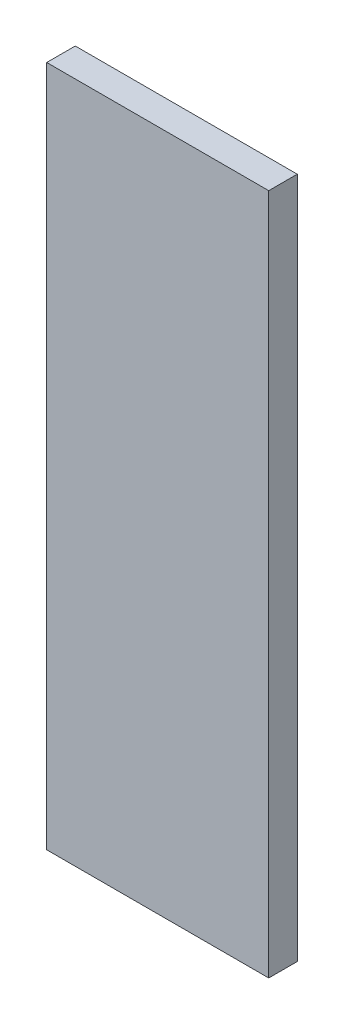
ISO-10303-21;
HEADER;
FILE_DESCRIPTION(('STEP AP214'),'2;1');
FILE_NAME('part.step','',(''),(''),'','','');
FILE_SCHEMA(('AUTOMOTIVE_DESIGN { 1 0 10303 214 1 1 1 1 }'));
ENDSEC;
DATA;
#1=APPLICATION_CONTEXT('core data for automotive mechanical design processes');
#2=APPLICATION_PROTOCOL_DEFINITION('international standard','automotive_design',2000,#1);
#3=PRODUCT_CONTEXT('',#1,'mechanical');
#4=PRODUCT('Part','Part','',(#3));
#5=PRODUCT_RELATED_PRODUCT_CATEGORY('part','',(#4));
#6=PRODUCT_DEFINITION_FORMATION('','',#4);
#7=PRODUCT_DEFINITION_CONTEXT('part definition',#1,'design');
#8=PRODUCT_DEFINITION('design','',#6,#7);
#9=PRODUCT_DEFINITION_SHAPE('','',#8);
#10=(LENGTH_UNIT() NAMED_UNIT(*) SI_UNIT(.MILLI.,.METRE.));
#11=(NAMED_UNIT(*) PLANE_ANGLE_UNIT() SI_UNIT($,.RADIAN.));
#12=(NAMED_UNIT(*) SI_UNIT($,.STERADIAN.) SOLID_ANGLE_UNIT());
#13=UNCERTAINTY_MEASURE_WITH_UNIT(LENGTH_MEASURE(1.E-05),#10,'distance_accuracy_value','');
#14=(GEOMETRIC_REPRESENTATION_CONTEXT(3) GLOBAL_UNCERTAINTY_ASSIGNED_CONTEXT((#13)) GLOBAL_UNIT_ASSIGNED_CONTEXT((#10,
#11,#12)) REPRESENTATION_CONTEXT('',''));
#15=CARTESIAN_POINT('',(0.,0.,0.));
#16=DIRECTION('',(0.,0.,1.));
#17=DIRECTION('',(1.,0.,0.));
#18=AXIS2_PLACEMENT_3D('',#15,#16,#17);
#19=CARTESIAN_POINT('',(70.,215.,18.));
#20=DIRECTION('',(-1.,0.,0.));
#21=DIRECTION('',(0.,-1.,0.));
#22=AXIS2_PLACEMENT_3D('',#19,#20,#21);
#23=PLANE('',#22);
#24=DIRECTION('',(0.,1.,0.));
#25=VECTOR('',#24,1.);
#26=CARTESIAN_POINT('',(70.,215.,0.));
#27=LINE('',#26,#25);
#28=CARTESIAN_POINT('',(70.,-215.,0.));
#29=VERTEX_POINT('',#28);
#30=CARTESIAN_POINT('',(70.,215.,0.));
#31=VERTEX_POINT('',#30);
#32=EDGE_CURVE('E96',#29,#31,#27,.T.);
#33=ORIENTED_EDGE('',*,*,#32,.T.);
#34=DIRECTION('',(0.,0.,-1.));
#35=VECTOR('',#34,1.);
#36=CARTESIAN_POINT('',(70.,215.,18.));
#37=LINE('',#36,#35);
#38=CARTESIAN_POINT('',(70.,215.,18.));
#39=VERTEX_POINT('',#38);
#40=EDGE_CURVE('E11',#39,#31,#37,.T.);
#41=ORIENTED_EDGE('',*,*,#40,.F.);
#42=DIRECTION('',(0.,1.,0.));
#43=VECTOR('',#42,1.);
#44=CARTESIAN_POINT('',(70.,215.,18.));
#45=LINE('',#44,#43);
#46=CARTESIAN_POINT('',(70.,-215.,18.));
#47=VERTEX_POINT('',#46);
#48=EDGE_CURVE('E84',#47,#39,#45,.T.);
#49=ORIENTED_EDGE('',*,*,#48,.F.);
#50=DIRECTION('',(0.,0.,-1.));
#51=VECTOR('',#50,1.);
#52=CARTESIAN_POINT('',(70.,-215.,18.));
#53=LINE('',#52,#51);
#54=EDGE_CURVE('E92',#47,#29,#53,.T.);
#55=ORIENTED_EDGE('',*,*,#54,.T.);
#56=EDGE_LOOP('',(#33,#41,#49,#55));
#57=FACE_BOUND('',#56,.T.);
#58=ADVANCED_FACE('F33',(#57),#23,.F.);
#59=CARTESIAN_POINT('',(-70.,215.,18.));
#60=DIRECTION('',(0.,-1.,0.));
#61=DIRECTION('',(0.,0.,-1.));
#62=AXIS2_PLACEMENT_3D('',#59,#60,#61);
#63=PLANE('',#62);
#64=DIRECTION('',(-1.,0.,0.));
#65=VECTOR('',#64,1.);
#66=CARTESIAN_POINT('',(-70.,215.,0.));
#67=LINE('',#66,#65);
#68=CARTESIAN_POINT('',(-70.,215.,0.));
#69=VERTEX_POINT('',#68);
#70=EDGE_CURVE('E88',#31,#69,#67,.T.);
#71=ORIENTED_EDGE('',*,*,#70,.T.);
#72=DIRECTION('',(0.,0.,-1.));
#73=VECTOR('',#72,1.);
#74=CARTESIAN_POINT('',(-70.,215.,18.));
#75=LINE('',#74,#73);
#76=CARTESIAN_POINT('',(-70.,215.,18.));
#77=VERTEX_POINT('',#76);
#78=EDGE_CURVE('E41',#77,#69,#75,.T.);
#79=ORIENTED_EDGE('',*,*,#78,.F.);
#80=DIRECTION('',(-1.,0.,0.));
#81=VECTOR('',#80,1.);
#82=CARTESIAN_POINT('',(-70.,215.,18.));
#83=LINE('',#82,#81);
#84=EDGE_CURVE('E79',#39,#77,#83,.T.);
#85=ORIENTED_EDGE('',*,*,#84,.F.);
#86=ORIENTED_EDGE('',*,*,#40,.T.);
#87=EDGE_LOOP('',(#71,#79,#85,#86));
#88=FACE_BOUND('',#87,.T.);
#89=ADVANCED_FACE('F87',(#88),#63,.F.);
#90=CARTESIAN_POINT('',(-70.,215.,18.));
#91=DIRECTION('',(1.,0.,0.));
#92=DIRECTION('',(0.,1.,0.));
#93=AXIS2_PLACEMENT_3D('',#90,#91,#92);
#94=PLANE('',#93);
#95=DIRECTION('',(0.,-1.,0.));
#96=VECTOR('',#95,1.);
#97=CARTESIAN_POINT('',(-70.,215.,0.));
#98=LINE('',#97,#96);
#99=CARTESIAN_POINT('',(-70.,-215.,0.));
#100=VERTEX_POINT('',#99);
#101=EDGE_CURVE('E66',#69,#100,#98,.T.);
#102=ORIENTED_EDGE('',*,*,#101,.T.);
#103=DIRECTION('',(0.,0.,-1.));
#104=VECTOR('',#103,1.);
#105=CARTESIAN_POINT('',(-70.,-215.,18.));
#106=LINE('',#105,#104);
#107=CARTESIAN_POINT('',(-70.,-215.,18.));
#108=VERTEX_POINT('',#107);
#109=EDGE_CURVE('E89',#108,#100,#106,.T.);
#110=ORIENTED_EDGE('',*,*,#109,.F.);
#111=DIRECTION('',(0.,-1.,0.));
#112=VECTOR('',#111,1.);
#113=CARTESIAN_POINT('',(-70.,215.,18.));
#114=LINE('',#113,#112);
#115=EDGE_CURVE('E82',#77,#108,#114,.T.);
#116=ORIENTED_EDGE('',*,*,#115,.F.);
#117=ORIENTED_EDGE('',*,*,#78,.T.);
#118=EDGE_LOOP('',(#102,#110,#116,#117));
#119=FACE_BOUND('',#118,.T.);
#120=ADVANCED_FACE('F90',(#119),#94,.F.);
#121=CARTESIAN_POINT('',(-70.,-215.,18.));
#122=DIRECTION('',(0.,1.,0.));
#123=DIRECTION('',(0.,0.,1.));
#124=AXIS2_PLACEMENT_3D('',#121,#122,#123);
#125=PLANE('',#124);
#126=DIRECTION('',(1.,0.,0.));
#127=VECTOR('',#126,1.);
#128=CARTESIAN_POINT('',(-70.,-215.,0.));
#129=LINE('',#128,#127);
#130=EDGE_CURVE('E72',#100,#29,#129,.T.);
#131=ORIENTED_EDGE('',*,*,#130,.T.);
#132=ORIENTED_EDGE('',*,*,#54,.F.);
#133=DIRECTION('',(1.,0.,0.));
#134=VECTOR('',#133,1.);
#135=CARTESIAN_POINT('',(-70.,-215.,18.));
#136=LINE('',#135,#134);
#137=EDGE_CURVE('E49',#108,#47,#136,.T.);
#138=ORIENTED_EDGE('',*,*,#137,.F.);
#139=ORIENTED_EDGE('',*,*,#109,.T.);
#140=EDGE_LOOP('',(#131,#132,#138,#139));
#141=FACE_BOUND('',#140,.T.);
#142=ADVANCED_FACE('F103',(#141),#125,.F.);
#143=CARTESIAN_POINT('',(0.,0.,18.));
#144=DIRECTION('',(0.,0.,1.));
#145=DIRECTION('',(1.,0.,0.));
#146=AXIS2_PLACEMENT_3D('',#143,#144,#145);
#147=PLANE('',#146);
#148=ORIENTED_EDGE('',*,*,#48,.T.);
#149=ORIENTED_EDGE('',*,*,#84,.T.);
#150=ORIENTED_EDGE('',*,*,#115,.T.);
#151=ORIENTED_EDGE('',*,*,#137,.T.);
#152=EDGE_LOOP('',(#148,#149,#150,#151));
#153=FACE_BOUND('',#152,.T.);
#154=ADVANCED_FACE('F80',(#153),#147,.T.);
#155=CARTESIAN_POINT('',(0.,0.,0.));
#156=DIRECTION('',(0.,0.,1.));
#157=DIRECTION('',(1.,0.,0.));
#158=AXIS2_PLACEMENT_3D('',#155,#156,#157);
#159=PLANE('',#158);
#160=ORIENTED_EDGE('',*,*,#32,.F.);
#161=ORIENTED_EDGE('',*,*,#130,.F.);
#162=ORIENTED_EDGE('',*,*,#101,.F.);
#163=ORIENTED_EDGE('',*,*,#70,.F.);
#164=EDGE_LOOP('',(#160,#161,#162,#163));
#165=FACE_BOUND('',#164,.T.);
#166=ADVANCED_FACE('F106',(#165),#159,.F.);
#167=CLOSED_SHELL('',(#58,#89,#120,#142,#154,#166));
#168=MANIFOLD_SOLID_BREP('B2',#167);
#169=ADVANCED_BREP_SHAPE_REPRESENTATION('',(#18,#168),#14);
#170=SHAPE_DEFINITION_REPRESENTATION(#9,#169);
ENDSEC;
END-ISO-10303-21;
